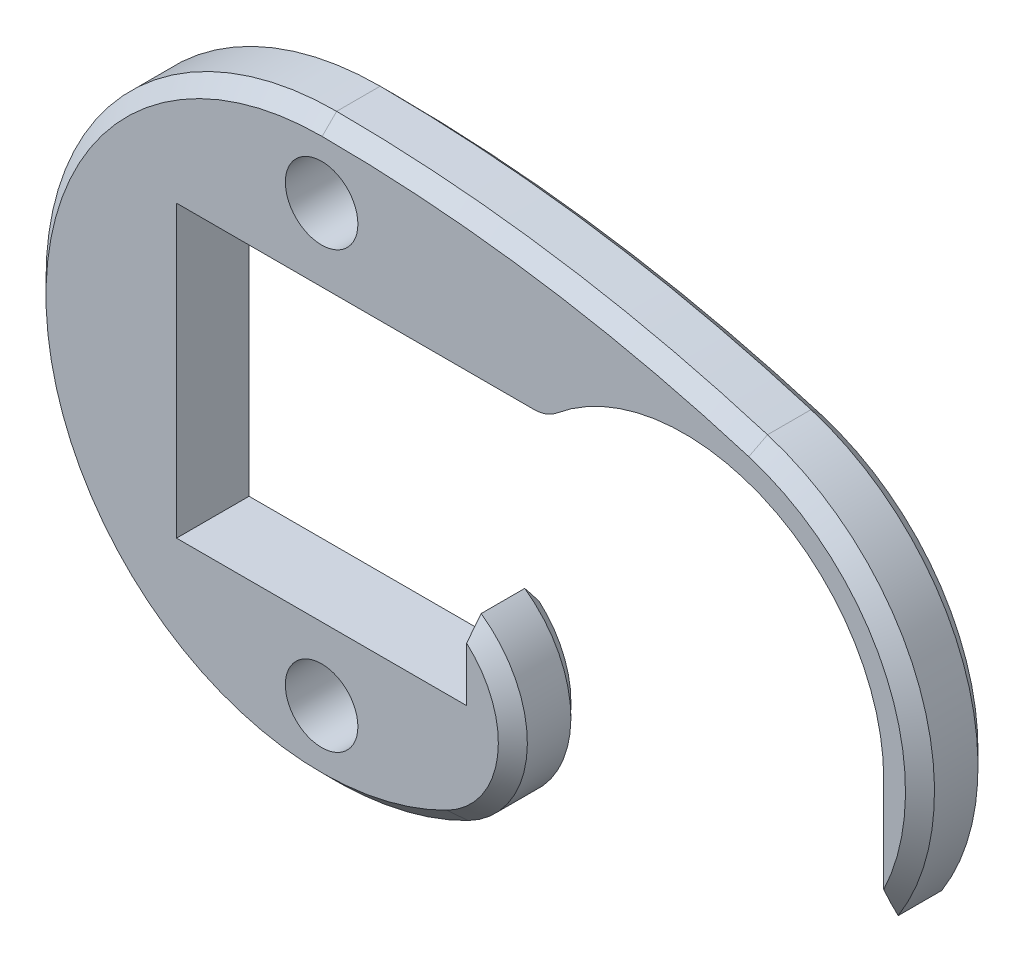
ISO-10303-21;
HEADER;
FILE_DESCRIPTION(('STEP AP214'),'2;1');
FILE_NAME('part.step','',(''),(''),'','','');
FILE_SCHEMA(('AUTOMOTIVE_DESIGN { 1 0 10303 214 1 1 1 1 }'));
ENDSEC;
DATA;
#1=APPLICATION_CONTEXT('core data for automotive mechanical design processes');
#2=APPLICATION_PROTOCOL_DEFINITION('international standard','automotive_design',2000,#1);
#3=PRODUCT_CONTEXT('',#1,'mechanical');
#4=PRODUCT('Part','Part','',(#3));
#5=PRODUCT_RELATED_PRODUCT_CATEGORY('part','',(#4));
#6=PRODUCT_DEFINITION_FORMATION('','',#4);
#7=PRODUCT_DEFINITION_CONTEXT('part definition',#1,'design');
#8=PRODUCT_DEFINITION('design','',#6,#7);
#9=PRODUCT_DEFINITION_SHAPE('','',#8);
#10=(LENGTH_UNIT() NAMED_UNIT(*) SI_UNIT(.MILLI.,.METRE.));
#11=(NAMED_UNIT(*) PLANE_ANGLE_UNIT() SI_UNIT($,.RADIAN.));
#12=(NAMED_UNIT(*) SI_UNIT($,.STERADIAN.) SOLID_ANGLE_UNIT());
#13=UNCERTAINTY_MEASURE_WITH_UNIT(LENGTH_MEASURE(1.E-05),#10,'distance_accuracy_value','');
#14=(GEOMETRIC_REPRESENTATION_CONTEXT(3) GLOBAL_UNCERTAINTY_ASSIGNED_CONTEXT((#13)) GLOBAL_UNIT_ASSIGNED_CONTEXT((#10,
#11,#12)) REPRESENTATION_CONTEXT('',''));
#15=CARTESIAN_POINT('',(0.,0.,0.));
#16=DIRECTION('',(0.,0.,1.));
#17=DIRECTION('',(1.,0.,0.));
#18=AXIS2_PLACEMENT_3D('',#15,#16,#17);
#19=CARTESIAN_POINT('',(-44.45,-12.7,3.175));
#20=DIRECTION('',(-1.,0.,0.));
#21=DIRECTION('',(0.,0.,1.));
#22=AXIS2_PLACEMENT_3D('',#19,#20,#21);
#23=PLANE('',#22);
#24=DIRECTION('',(0.,1.,0.));
#25=VECTOR('',#24,1.);
#26=CARTESIAN_POINT('',(-44.45,-12.7,-3.175));
#27=LINE('',#26,#25);
#28=CARTESIAN_POINT('',(-44.45,-12.7,-3.175));
#29=VERTEX_POINT('',#28);
#30=CARTESIAN_POINT('',(-44.45,12.7,-3.175));
#31=VERTEX_POINT('',#30);
#32=EDGE_CURVE('E185',#29,#31,#27,.T.);
#33=ORIENTED_EDGE('',*,*,#32,.T.);
#34=DIRECTION('',(0.,0.,-1.));
#35=VECTOR('',#34,1.);
#36=CARTESIAN_POINT('',(-44.45,12.7,3.175));
#37=LINE('',#36,#35);
#38=CARTESIAN_POINT('',(-44.45,12.7,3.175));
#39=VERTEX_POINT('',#38);
#40=EDGE_CURVE('E165',#39,#31,#37,.T.);
#41=ORIENTED_EDGE('',*,*,#40,.F.);
#42=DIRECTION('',(0.,1.,0.));
#43=VECTOR('',#42,1.);
#44=CARTESIAN_POINT('',(-44.45,-12.7,3.175));
#45=LINE('',#44,#43);
#46=CARTESIAN_POINT('',(-44.45,-12.7,3.175));
#47=VERTEX_POINT('',#46);
#48=EDGE_CURVE('E171',#47,#39,#45,.T.);
#49=ORIENTED_EDGE('',*,*,#48,.F.);
#50=DIRECTION('',(0.,0.,-1.));
#51=VECTOR('',#50,1.);
#52=CARTESIAN_POINT('',(-44.45,-12.7,3.175));
#53=LINE('',#52,#51);
#54=EDGE_CURVE('E351',#47,#29,#53,.T.);
#55=ORIENTED_EDGE('',*,*,#54,.T.);
#56=EDGE_LOOP('',(#33,#41,#49,#55));
#57=FACE_BOUND('',#56,.T.);
#58=ADVANCED_FACE('F46',(#57),#23,.F.);
#59=CARTESIAN_POINT('',(-44.45,12.7,3.175));
#60=DIRECTION('',(0.,1.,0.));
#61=DIRECTION('',(0.,0.,1.));
#62=AXIS2_PLACEMENT_3D('',#59,#60,#61);
#63=PLANE('',#62);
#64=DIRECTION('',(1.,0.,0.));
#65=VECTOR('',#64,1.);
#66=CARTESIAN_POINT('',(-44.45,12.7,-3.175));
#67=LINE('',#66,#65);
#68=CARTESIAN_POINT('',(-13.1867653823824,12.7,-3.175));
#69=VERTEX_POINT('',#68);
#70=EDGE_CURVE('E357',#31,#69,#67,.T.);
#71=ORIENTED_EDGE('',*,*,#70,.T.);
#72=DIRECTION('',(0.,0.,-1.));
#73=VECTOR('',#72,1.);
#74=CARTESIAN_POINT('',(-13.1867653823824,12.7,3.175));
#75=LINE('',#74,#73);
#76=CARTESIAN_POINT('',(-13.1867653823824,12.7,3.175));
#77=VERTEX_POINT('',#76);
#78=EDGE_CURVE('E168',#69,#77,#75,.F.);
#79=ORIENTED_EDGE('',*,*,#78,.T.);
#80=DIRECTION('',(1.,0.,0.));
#81=VECTOR('',#80,1.);
#82=CARTESIAN_POINT('',(-44.45,12.7,3.175));
#83=LINE('',#82,#81);
#84=EDGE_CURVE('E160',#39,#77,#83,.T.);
#85=ORIENTED_EDGE('',*,*,#84,.F.);
#86=ORIENTED_EDGE('',*,*,#40,.T.);
#87=EDGE_LOOP('',(#71,#79,#85,#86));
#88=FACE_BOUND('',#87,.T.);
#89=ADVANCED_FACE('F163',(#88),#63,.F.);
#90=CARTESIAN_POINT('',(0.,0.,3.175));
#91=DIRECTION('',(0.,0.,-1.));
#92=DIRECTION('',(-1.,0.,0.));
#93=AXIS2_PLACEMENT_3D('',#90,#91,#92);
#94=CYLINDRICAL_SURFACE('',#93,17.4625);
#95=CARTESIAN_POINT('',(0.,0.,3.175));
#96=DIRECTION('',(0.,0.,-1.));
#97=DIRECTION('',(1.,0.,0.));
#98=AXIS2_PLACEMENT_3D('',#95,#96,#97);
#99=CIRCLE('',#98,17.4625);
#100=CARTESIAN_POINT('',(-11.1580322466313,13.4326923076923,3.175));
#101=VERTEX_POINT('',#100);
#102=CARTESIAN_POINT('',(17.4625,0.,3.175));
#103=VERTEX_POINT('',#102);
#104=EDGE_CURVE('E170',#101,#103,#99,.T.);
#105=ORIENTED_EDGE('',*,*,#104,.F.);
#106=DIRECTION('',(0.,0.,-1.));
#107=VECTOR('',#106,1.);
#108=CARTESIAN_POINT('',(-11.1580322466313,13.4326923076923,3.175));
#109=LINE('',#108,#107);
#110=CARTESIAN_POINT('',(-11.1580322466313,13.4326923076923,-3.175));
#111=VERTEX_POINT('',#110);
#112=EDGE_CURVE('E186',#101,#111,#109,.T.);
#113=ORIENTED_EDGE('',*,*,#112,.T.);
#114=CARTESIAN_POINT('',(0.,0.,-3.175));
#115=DIRECTION('',(0.,0.,-1.));
#116=DIRECTION('',(1.,0.,0.));
#117=AXIS2_PLACEMENT_3D('',#114,#115,#116);
#118=CIRCLE('',#117,17.4625);
#119=CARTESIAN_POINT('',(17.4625,0.,-3.175));
#120=VERTEX_POINT('',#119);
#121=EDGE_CURVE('E360',#111,#120,#118,.T.);
#122=ORIENTED_EDGE('',*,*,#121,.T.);
#123=DIRECTION('',(0.,0.,-1.));
#124=VECTOR('',#123,1.);
#125=CARTESIAN_POINT('',(17.4625,0.,3.175));
#126=LINE('',#125,#124);
#127=EDGE_CURVE('E187',#103,#120,#126,.T.);
#128=ORIENTED_EDGE('',*,*,#127,.F.);
#129=EDGE_LOOP('',(#105,#113,#122,#128));
#130=FACE_BOUND('',#129,.T.);
#131=ADVANCED_FACE('F247',(#130),#94,.F.);
#132=CARTESIAN_POINT('',(17.4625,-10.9985226280624,3.175));
#133=DIRECTION('',(1.,0.,0.));
#134=DIRECTION('',(0.,1.,0.));
#135=AXIS2_PLACEMENT_3D('',#132,#133,#134);
#136=PLANE('',#135);
#137=DIRECTION('',(0.,-1.,0.));
#138=VECTOR('',#137,1.);
#139=CARTESIAN_POINT('',(17.4625,-10.9985226280624,-3.175));
#140=LINE('',#139,#138);
#141=CARTESIAN_POINT('',(17.4625,-8.3762252835033,-3.175));
#142=VERTEX_POINT('',#141);
#143=EDGE_CURVE('E362',#120,#142,#140,.T.);
#144=ORIENTED_EDGE('',*,*,#143,.T.);
#145=CARTESIAN_POINT('',(17.4625,-8.3762252835033,-3.175));
#146=CARTESIAN_POINT('',(17.4625,-8.59919625962574,-3.07856318760652));
#147=CARTESIAN_POINT('',(17.4625,-8.82102118509475,-2.97950052772163));
#148=CARTESIAN_POINT('',(17.4625,-9.26235587292495,-2.77657690041617));
#149=CARTESIAN_POINT('',(17.4625,-9.4818665545083,-2.67271793364534));
#150=CARTESIAN_POINT('',(17.4625,-9.91872471990675,-2.46057913898252));
#151=CARTESIAN_POINT('',(17.4625,-10.1360722946509,-2.35229949790403));
#152=CARTESIAN_POINT('',(17.4625,-10.5687862207038,-2.13163166167767));
#153=CARTESIAN_POINT('',(17.4625,-10.7841517155519,-2.01924178604076));
#154=CARTESIAN_POINT('',(17.4625,-10.9985226280624,-1.905));
#155=B_SPLINE_CURVE_WITH_KNOTS('',3,(#145,#146,#147,#148,#149,#150,#151,#152,#153,#154),
.UNSPECIFIED.,.F.,.F.,(4,2,2,2,4),(0.,0.728766437002155,1.45723158707932,2.18566598470928,
2.91440161095463),.UNSPECIFIED.);
#156=CARTESIAN_POINT('',(17.4625,-10.9985226280624,-1.90499999999999));
#157=VERTEX_POINT('',#156);
#158=EDGE_CURVE('E259',#142,#157,#155,.T.);
#159=ORIENTED_EDGE('',*,*,#158,.T.);
#160=DIRECTION('',(0.,0.,-1.));
#161=VECTOR('',#160,1.);
#162=CARTESIAN_POINT('',(17.4625,-10.9985226280624,3.175));
#163=LINE('',#162,#161);
#164=CARTESIAN_POINT('',(17.4625,-10.9985226280624,1.90499999999999));
#165=VERTEX_POINT('',#164);
#166=EDGE_CURVE('E193',#165,#157,#163,.T.);
#167=ORIENTED_EDGE('',*,*,#166,.F.);
#168=CARTESIAN_POINT('',(17.4625,-10.9985226280624,1.90499999999999));
#169=CARTESIAN_POINT('',(17.4625,-10.7841517155519,2.01924178604076));
#170=CARTESIAN_POINT('',(17.4625,-10.5687862207038,2.13163166167767));
#171=CARTESIAN_POINT('',(17.4625,-10.1360722946509,2.35229949790403));
#172=CARTESIAN_POINT('',(17.4625,-9.91872471990674,2.46057913898252));
#173=CARTESIAN_POINT('',(17.4625,-9.48186655450829,2.67271793364534));
#174=CARTESIAN_POINT('',(17.4625,-9.26235587292494,2.77657690041617));
#175=CARTESIAN_POINT('',(17.4625,-8.82102118509474,2.97950052772164));
#176=CARTESIAN_POINT('',(17.4625,-8.59919625962572,3.07856318760653));
#177=CARTESIAN_POINT('',(17.4625,-8.37622528350328,3.175));
#178=B_SPLINE_CURVE_WITH_KNOTS('',3,(#168,#169,#170,#171,#172,#173,#174,#175,#176,#177),
.UNSPECIFIED.,.F.,.F.,(4,2,2,2,4),(0.,0.728735626245356,1.45717002387532,2.18563517395249,
2.91440161095465),.UNSPECIFIED.);
#179=CARTESIAN_POINT('',(17.4625,-8.37622528350329,3.175));
#180=VERTEX_POINT('',#179);
#181=EDGE_CURVE('E252',#165,#180,#178,.T.);
#182=ORIENTED_EDGE('',*,*,#181,.T.);
#183=DIRECTION('',(0.,-1.,0.));
#184=VECTOR('',#183,1.);
#185=CARTESIAN_POINT('',(17.4625,-10.9985226280624,3.175));
#186=LINE('',#185,#184);
#187=EDGE_CURVE('E349',#103,#180,#186,.T.);
#188=ORIENTED_EDGE('',*,*,#187,.F.);
#189=ORIENTED_EDGE('',*,*,#127,.T.);
#190=EDGE_LOOP('',(#144,#159,#167,#182,#188,#189));
#191=FACE_BOUND('',#190,.T.);
#192=ADVANCED_FACE('F242',(#191),#136,.F.);
#193=CARTESIAN_POINT('',(0.,0.,3.175));
#194=DIRECTION('',(0.,0.,-1.));
#195=DIRECTION('',(-1.,0.,0.));
#196=AXIS2_PLACEMENT_3D('',#193,#194,#195);
#197=CYLINDRICAL_SURFACE('',#196,20.6375);
#198=ORIENTED_EDGE('',*,*,#166,.T.);
#199=CARTESIAN_POINT('',(0.,0.,-1.90499999999999));
#200=DIRECTION('',(0.,0.,1.));
#201=DIRECTION('',(1.,0.,0.));
#202=AXIS2_PLACEMENT_3D('',#199,#200,#201);
#203=CIRCLE('',#202,20.6375);
#204=CARTESIAN_POINT('',(6.01927083333334,19.7401819871293,-1.90499999999999));
#205=VERTEX_POINT('',#204);
#206=EDGE_CURVE('E384',#157,#205,#203,.T.);
#207=ORIENTED_EDGE('',*,*,#206,.T.);
#208=DIRECTION('',(0.,0.,-1.));
#209=VECTOR('',#208,1.);
#210=CARTESIAN_POINT('',(6.01927083333334,19.7401819871293,3.175));
#211=LINE('',#210,#209);
#212=CARTESIAN_POINT('',(6.01927083333334,19.7401819871293,1.90499999999999));
#213=VERTEX_POINT('',#212);
#214=EDGE_CURVE('E378',#213,#205,#211,.T.);
#215=ORIENTED_EDGE('',*,*,#214,.F.);
#216=CARTESIAN_POINT('',(0.,0.,1.90499999999999));
#217=DIRECTION('',(0.,0.,1.));
#218=DIRECTION('',(1.,0.,0.));
#219=AXIS2_PLACEMENT_3D('',#216,#217,#218);
#220=CIRCLE('',#219,20.6375);
#221=EDGE_CURVE('E386',#213,#165,#220,.F.);
#222=ORIENTED_EDGE('',*,*,#221,.T.);
#223=EDGE_LOOP('',(#198,#207,#215,#222));
#224=FACE_BOUND('',#223,.T.);
#225=ADVANCED_FACE('F238',(#224),#197,.T.);
#226=CARTESIAN_POINT('',(-31.9484375,-104.774812085532,3.175));
#227=DIRECTION('',(0.,0.,-1.));
#228=DIRECTION('',(-1.,0.,0.));
#229=AXIS2_PLACEMENT_3D('',#226,#227,#228);
#230=CYLINDRICAL_SURFACE('',#229,130.175);
#231=ORIENTED_EDGE('',*,*,#214,.T.);
#232=CARTESIAN_POINT('',(-31.9484375,-104.774812085532,-1.90499999999999));
#233=DIRECTION('',(0.,0.,1.));
#234=DIRECTION('',(1.,0.,0.));
#235=AXIS2_PLACEMENT_3D('',#232,#233,#234);
#236=CIRCLE('',#235,130.175);
#237=CARTESIAN_POINT('',(-31.7018939393939,25.3999544449775,-1.90499999999999));
#238=VERTEX_POINT('',#237);
#239=EDGE_CURVE('E391',#205,#238,#236,.T.);
#240=ORIENTED_EDGE('',*,*,#239,.T.);
#241=DIRECTION('',(0.,0.,-1.));
#242=VECTOR('',#241,1.);
#243=CARTESIAN_POINT('',(-31.7018939393939,25.3999544449775,3.175));
#244=LINE('',#243,#242);
#245=CARTESIAN_POINT('',(-31.7018939393939,25.3999544449775,1.90499999999999));
#246=VERTEX_POINT('',#245);
#247=EDGE_CURVE('E375',#246,#238,#244,.T.);
#248=ORIENTED_EDGE('',*,*,#247,.F.);
#249=CARTESIAN_POINT('',(-31.9484375,-104.774812085532,1.90499999999999));
#250=DIRECTION('',(0.,0.,1.));
#251=DIRECTION('',(1.,0.,0.));
#252=AXIS2_PLACEMENT_3D('',#249,#250,#251);
#253=CIRCLE('',#252,130.175);
#254=EDGE_CURVE('E395',#246,#213,#253,.F.);
#255=ORIENTED_EDGE('',*,*,#254,.T.);
#256=EDGE_LOOP('',(#231,#240,#248,#255));
#257=FACE_BOUND('',#256,.T.);
#258=ADVANCED_FACE('F234',(#257),#230,.T.);
#259=CARTESIAN_POINT('',(-31.75,0.,3.175));
#260=DIRECTION('',(0.,0.,-1.));
#261=DIRECTION('',(-1.,0.,0.));
#262=AXIS2_PLACEMENT_3D('',#259,#260,#261);
#263=CYLINDRICAL_SURFACE('',#262,25.4);
#264=ORIENTED_EDGE('',*,*,#247,.T.);
#265=CARTESIAN_POINT('',(-31.75,0.,-1.90499999999999));
#266=DIRECTION('',(0.,0.,1.));
#267=DIRECTION('',(1.,0.,0.));
#268=AXIS2_PLACEMENT_3D('',#265,#266,#267);
#269=CIRCLE('',#268,25.4);
#270=CARTESIAN_POINT('',(-20.2013815740022,-22.6227631480043,-1.90499999999999));
#271=VERTEX_POINT('',#270);
#272=EDGE_CURVE('E320',#238,#271,#269,.T.);
#273=ORIENTED_EDGE('',*,*,#272,.T.);
#274=DIRECTION('',(0.,0.,-1.));
#275=VECTOR('',#274,1.);
#276=CARTESIAN_POINT('',(-20.2013815740022,-22.6227631480043,3.175));
#277=LINE('',#276,#275);
#278=CARTESIAN_POINT('',(-20.2013815740022,-22.6227631480043,1.90499999999999));
#279=VERTEX_POINT('',#278);
#280=EDGE_CURVE('E372',#279,#271,#277,.T.);
#281=ORIENTED_EDGE('',*,*,#280,.F.);
#282=CARTESIAN_POINT('',(-31.75,0.,1.90499999999999));
#283=DIRECTION('',(0.,0.,1.));
#284=DIRECTION('',(1.,0.,0.));
#285=AXIS2_PLACEMENT_3D('',#282,#283,#284);
#286=CIRCLE('',#285,25.4);
#287=EDGE_CURVE('E338',#279,#246,#286,.F.);
#288=ORIENTED_EDGE('',*,*,#287,.T.);
#289=EDGE_LOOP('',(#264,#273,#281,#288));
#290=FACE_BOUND('',#289,.T.);
#291=ADVANCED_FACE('F230',(#290),#263,.T.);
#292=CARTESIAN_POINT('',(-24.5321134837514,-14.1392269675027,3.175));
#293=DIRECTION('',(0.,0.,-1.));
#294=DIRECTION('',(-1.,0.,0.));
#295=AXIS2_PLACEMENT_3D('',#292,#293,#294);
#296=CYLINDRICAL_SURFACE('',#295,9.525);
#297=ORIENTED_EDGE('',*,*,#280,.T.);
#298=CARTESIAN_POINT('',(-24.5321134837514,-14.1392269675027,-1.90499999999999));
#299=DIRECTION('',(0.,0.,1.));
#300=DIRECTION('',(1.,0.,0.));
#301=AXIS2_PLACEMENT_3D('',#298,#299,#300);
#302=CIRCLE('',#301,9.525);
#303=CARTESIAN_POINT('',(-19.05,-6.35,-1.90499999999999));
#304=VERTEX_POINT('',#303);
#305=EDGE_CURVE('E203',#271,#304,#302,.T.);
#306=ORIENTED_EDGE('',*,*,#305,.T.);
#307=DIRECTION('',(0.,0.,-1.));
#308=VECTOR('',#307,1.);
#309=CARTESIAN_POINT('',(-19.05,-6.35,3.175));
#310=LINE('',#309,#308);
#311=CARTESIAN_POINT('',(-19.05,-6.35,1.90499999999999));
#312=VERTEX_POINT('',#311);
#313=EDGE_CURVE('E370',#312,#304,#310,.T.);
#314=ORIENTED_EDGE('',*,*,#313,.F.);
#315=CARTESIAN_POINT('',(-24.5321134837514,-14.1392269675027,1.90499999999999));
#316=DIRECTION('',(0.,0.,1.));
#317=DIRECTION('',(1.,0.,0.));
#318=AXIS2_PLACEMENT_3D('',#315,#316,#317);
#319=CIRCLE('',#318,9.525);
#320=EDGE_CURVE('E201',#312,#279,#319,.F.);
#321=ORIENTED_EDGE('',*,*,#320,.T.);
#322=EDGE_LOOP('',(#297,#306,#314,#321));
#323=FACE_BOUND('',#322,.T.);
#324=ADVANCED_FACE('F224',(#323),#296,.T.);
#325=CARTESIAN_POINT('',(-19.05,-12.7,3.175));
#326=DIRECTION('',(1.,0.,0.));
#327=DIRECTION('',(0.,0.,-1.));
#328=AXIS2_PLACEMENT_3D('',#325,#326,#327);
#329=PLANE('',#328);
#330=ORIENTED_EDGE('',*,*,#313,.T.);
#331=CARTESIAN_POINT('',(-19.05,-6.35,-1.90499999999999));
#332=CARTESIAN_POINT('',(-19.05,-6.48267794292335,-2.01349262529382));
#333=CARTESIAN_POINT('',(-19.05,-6.61580056629095,-2.12144445828109));
#334=CARTESIAN_POINT('',(-19.05,-6.88304075114208,-2.33607684838612));
#335=CARTESIAN_POINT('',(-19.05,-7.01715819472569,-2.44275755236442));
#336=CARTESIAN_POINT('',(-19.05,-7.2865277837613,-2.6546859752937));
#337=CARTESIAN_POINT('',(-19.05,-7.4217799567828,-2.75993365926394));
#338=CARTESIAN_POINT('',(-19.05,-7.6935822500914,-2.96877167981918));
#339=CARTESIAN_POINT('',(-19.05,-7.830132520164,-3.07236182134981));
#340=CARTESIAN_POINT('',(-19.05,-7.96739930049262,-3.175));
#341=B_SPLINE_CURVE_WITH_KNOTS('',3,(#331,#332,#333,#334,#335,#336,#337,#338,#339,#340),
.UNSPECIFIED.,.F.,.F.,(4,2,2,2,4),(0.,0.514167390157872,1.02827478818611,1.54239471340719,
2.05657470017516),.UNSPECIFIED.);
#342=CARTESIAN_POINT('',(-19.05,-7.96739930049262,-3.175));
#343=VERTEX_POINT('',#342);
#344=EDGE_CURVE('E212',#304,#343,#341,.T.);
#345=ORIENTED_EDGE('',*,*,#344,.T.);
#346=DIRECTION('',(0.,-1.,0.));
#347=VECTOR('',#346,1.);
#348=CARTESIAN_POINT('',(-19.05,-12.7,-3.175));
#349=LINE('',#348,#347);
#350=CARTESIAN_POINT('',(-19.05,-12.7,-3.175));
#351=VERTEX_POINT('',#350);
#352=EDGE_CURVE('E365',#343,#351,#349,.T.);
#353=ORIENTED_EDGE('',*,*,#352,.T.);
#354=DIRECTION('',(0.,0.,-1.));
#355=VECTOR('',#354,1.);
#356=CARTESIAN_POINT('',(-19.05,-12.7,3.175));
#357=LINE('',#356,#355);
#358=CARTESIAN_POINT('',(-19.05,-12.7,3.175));
#359=VERTEX_POINT('',#358);
#360=EDGE_CURVE('E348',#359,#351,#357,.T.);
#361=ORIENTED_EDGE('',*,*,#360,.F.);
#362=DIRECTION('',(0.,-1.,0.));
#363=VECTOR('',#362,1.);
#364=CARTESIAN_POINT('',(-19.05,-12.7,3.175));
#365=LINE('',#364,#363);
#366=CARTESIAN_POINT('',(-19.05,-7.96739930049263,3.175));
#367=VERTEX_POINT('',#366);
#368=EDGE_CURVE('E343',#367,#359,#365,.T.);
#369=ORIENTED_EDGE('',*,*,#368,.F.);
#370=CARTESIAN_POINT('',(-19.05,-7.96739930049263,3.175));
#371=CARTESIAN_POINT('',(-19.05,-7.83013252016401,3.07236182134981));
#372=CARTESIAN_POINT('',(-19.05,-7.69358225009141,2.96877167981918));
#373=CARTESIAN_POINT('',(-19.05,-7.42177995678281,2.75993365926394));
#374=CARTESIAN_POINT('',(-19.05,-7.2865277837613,2.6546859752937));
#375=CARTESIAN_POINT('',(-19.05,-7.01715819472569,2.44275755236443));
#376=CARTESIAN_POINT('',(-19.05,-6.88304075114208,2.33607684838612));
#377=CARTESIAN_POINT('',(-19.05,-6.61580056629096,2.12144445828109));
#378=CARTESIAN_POINT('',(-19.05,-6.48267794292335,2.01349262529382));
#379=CARTESIAN_POINT('',(-19.05,-6.35,1.90499999999999));
#380=B_SPLINE_CURVE_WITH_KNOTS('',3,(#370,#371,#372,#373,#374,#375,#376,#377,#378,#379),
.UNSPECIFIED.,.F.,.F.,(4,2,2,2,4),(0.,0.514179986767978,1.02829991198906,1.5424073100173,
2.05657470017517),.UNSPECIFIED.);
#381=EDGE_CURVE('E206',#367,#312,#380,.T.);
#382=ORIENTED_EDGE('',*,*,#381,.T.);
#383=EDGE_LOOP('',(#330,#345,#353,#361,#369,#382));
#384=FACE_BOUND('',#383,.T.);
#385=ADVANCED_FACE('F218',(#384),#329,.F.);
#386=CARTESIAN_POINT('',(-19.05,-12.7,3.175));
#387=DIRECTION('',(0.,-1.,0.));
#388=DIRECTION('',(0.,0.,-1.));
#389=AXIS2_PLACEMENT_3D('',#386,#387,#388);
#390=PLANE('',#389);
#391=DIRECTION('',(-1.,0.,0.));
#392=VECTOR('',#391,1.);
#393=CARTESIAN_POINT('',(-19.05,-12.7,-3.175));
#394=LINE('',#393,#392);
#395=EDGE_CURVE('E182',#351,#29,#394,.T.);
#396=ORIENTED_EDGE('',*,*,#395,.T.);
#397=ORIENTED_EDGE('',*,*,#54,.F.);
#398=DIRECTION('',(-1.,0.,0.));
#399=VECTOR('',#398,1.);
#400=CARTESIAN_POINT('',(-19.05,-12.7,3.175));
#401=LINE('',#400,#399);
#402=EDGE_CURVE('E178',#359,#47,#401,.T.);
#403=ORIENTED_EDGE('',*,*,#402,.F.);
#404=ORIENTED_EDGE('',*,*,#360,.T.);
#405=EDGE_LOOP('',(#396,#397,#403,#404));
#406=FACE_BOUND('',#405,.T.);
#407=ADVANCED_FACE('F223',(#406),#390,.F.);
#408=CARTESIAN_POINT('',(0.,0.,3.175));
#409=DIRECTION('',(0.,0.,1.));
#410=DIRECTION('',(1.,0.,0.));
#411=AXIS2_PLACEMENT_3D('',#408,#409,#410);
#412=PLANE('',#411);
#413=ORIENTED_EDGE('',*,*,#187,.T.);
#414=CARTESIAN_POINT('',(0.,0.,3.175));
#415=DIRECTION('',(0.,0.,1.));
#416=DIRECTION('',(1.,0.,0.));
#417=AXIS2_PLACEMENT_3D('',#414,#415,#416);
#418=CIRCLE('',#417,19.3675);
#419=CARTESIAN_POINT('',(5.64885416666666,18.5254015571521,3.175));
#420=VERTEX_POINT('',#419);
#421=EDGE_CURVE('E13',#180,#420,#418,.T.);
#422=ORIENTED_EDGE('',*,*,#421,.T.);
#423=CARTESIAN_POINT('',(-31.9484375,-104.774812085532,3.175));
#424=DIRECTION('',(0.,0.,1.));
#425=DIRECTION('',(1.,0.,0.));
#426=AXIS2_PLACEMENT_3D('',#423,#424,#425);
#427=CIRCLE('',#426,128.905);
#428=CARTESIAN_POINT('',(-31.7042992424242,24.1299567227287,3.175));
#429=VERTEX_POINT('',#428);
#430=EDGE_CURVE('E68',#420,#429,#427,.T.);
#431=ORIENTED_EDGE('',*,*,#430,.T.);
#432=CARTESIAN_POINT('',(-31.75,0.,3.175));
#433=DIRECTION('',(0.,0.,1.));
#434=DIRECTION('',(1.,0.,0.));
#435=AXIS2_PLACEMENT_3D('',#432,#433,#434);
#436=CIRCLE('',#435,24.13);
#437=CARTESIAN_POINT('',(-20.7788124953021,-21.4916249906041,3.175));
#438=VERTEX_POINT('',#437);
#439=EDGE_CURVE('E64',#429,#438,#436,.T.);
#440=ORIENTED_EDGE('',*,*,#439,.T.);
#441=CARTESIAN_POINT('',(-24.5321134837514,-14.1392269675027,3.175));
#442=DIRECTION('',(0.,0.,1.));
#443=DIRECTION('',(1.,0.,0.));
#444=AXIS2_PLACEMENT_3D('',#441,#442,#443);
#445=CIRCLE('',#444,8.25499999999998);
#446=EDGE_CURVE('E56',#438,#367,#445,.T.);
#447=ORIENTED_EDGE('',*,*,#446,.T.);
#448=ORIENTED_EDGE('',*,*,#368,.T.);
#449=ORIENTED_EDGE('',*,*,#402,.T.);
#450=ORIENTED_EDGE('',*,*,#48,.T.);
#451=ORIENTED_EDGE('',*,*,#84,.T.);
#452=CARTESIAN_POINT('',(-13.1867653823824,15.875,3.175));
#453=DIRECTION('',(0.,0.,1.));
#454=DIRECTION('',(1.,0.,0.));
#455=AXIS2_PLACEMENT_3D('',#452,#453,#454);
#456=CIRCLE('',#455,3.175);
#457=EDGE_CURVE('E199',#77,#101,#456,.T.);
#458=ORIENTED_EDGE('',*,*,#457,.T.);
#459=ORIENTED_EDGE('',*,*,#104,.T.);
#460=EDGE_LOOP('',(#413,#422,#431,#440,#447,#448,#449,#450,#451,#458,#459));
#461=FACE_BOUND('',#460,.T.);
#462=CARTESIAN_POINT('',(-31.75,-19.05,3.175));
#463=DIRECTION('',(0.,0.,1.));
#464=DIRECTION('',(1.,0.,0.));
#465=AXIS2_PLACEMENT_3D('',#462,#463,#464);
#466=CIRCLE('',#465,3.175);
#467=CARTESIAN_POINT('',(-28.575,-19.05,3.175));
#468=VERTEX_POINT('',#467);
#469=EDGE_CURVE('E358',#468,#468,#466,.T.);
#470=ORIENTED_EDGE('',*,*,#469,.F.);
#471=EDGE_LOOP('',(#470));
#472=FACE_BOUND('',#471,.T.);
#473=CARTESIAN_POINT('',(-31.75,19.05,3.175));
#474=DIRECTION('',(0.,0.,1.));
#475=DIRECTION('',(1.,0.,0.));
#476=AXIS2_PLACEMENT_3D('',#473,#474,#475);
#477=CIRCLE('',#476,3.175);
#478=CARTESIAN_POINT('',(-28.575,19.05,3.175));
#479=VERTEX_POINT('',#478);
#480=EDGE_CURVE('E571',#479,#479,#477,.T.);
#481=ORIENTED_EDGE('',*,*,#480,.F.);
#482=EDGE_LOOP('',(#481));
#483=FACE_BOUND('',#482,.T.);
#484=ADVANCED_FACE('F175',(#461,#472,#483),#412,.T.);
#485=CARTESIAN_POINT('',(0.,0.,-3.175));
#486=DIRECTION('',(0.,0.,1.));
#487=DIRECTION('',(1.,0.,0.));
#488=AXIS2_PLACEMENT_3D('',#485,#486,#487);
#489=PLANE('',#488);
#490=CARTESIAN_POINT('',(-31.75,-19.05,-3.175));
#491=DIRECTION('',(0.,0.,1.));
#492=DIRECTION('',(1.,0.,0.));
#493=AXIS2_PLACEMENT_3D('',#490,#491,#492);
#494=CIRCLE('',#493,3.175);
#495=CARTESIAN_POINT('',(-28.575,-19.05,-3.175));
#496=VERTEX_POINT('',#495);
#497=EDGE_CURVE('E570',#496,#496,#494,.T.);
#498=ORIENTED_EDGE('',*,*,#497,.T.);
#499=EDGE_LOOP('',(#498));
#500=FACE_BOUND('',#499,.T.);
#501=CARTESIAN_POINT('',(-31.75,19.05,-3.175));
#502=DIRECTION('',(0.,0.,1.));
#503=DIRECTION('',(-1.,0.,0.));
#504=AXIS2_PLACEMENT_3D('',#501,#502,#503);
#505=CIRCLE('',#504,3.175);
#506=CARTESIAN_POINT('',(-34.925,19.05,-3.175));
#507=VERTEX_POINT('',#506);
#508=EDGE_CURVE('E327',#507,#507,#505,.T.);
#509=ORIENTED_EDGE('',*,*,#508,.T.);
#510=EDGE_LOOP('',(#509));
#511=FACE_BOUND('',#510,.T.);
#512=ORIENTED_EDGE('',*,*,#352,.F.);
#513=CARTESIAN_POINT('',(-24.5321134837514,-14.1392269675027,-3.175));
#514=DIRECTION('',(0.,0.,1.));
#515=DIRECTION('',(1.,0.,0.));
#516=AXIS2_PLACEMENT_3D('',#513,#514,#515);
#517=CIRCLE('',#516,8.25499999999998);
#518=CARTESIAN_POINT('',(-20.7788124953021,-21.4916249906041,-3.175));
#519=VERTEX_POINT('',#518);
#520=EDGE_CURVE('E399',#343,#519,#517,.F.);
#521=ORIENTED_EDGE('',*,*,#520,.T.);
#522=CARTESIAN_POINT('',(-31.75,0.,-3.175));
#523=DIRECTION('',(0.,0.,1.));
#524=DIRECTION('',(1.,0.,0.));
#525=AXIS2_PLACEMENT_3D('',#522,#523,#524);
#526=CIRCLE('',#525,24.13);
#527=CARTESIAN_POINT('',(-31.7042992424242,24.1299567227286,-3.175));
#528=VERTEX_POINT('',#527);
#529=EDGE_CURVE('E318',#519,#528,#526,.F.);
#530=ORIENTED_EDGE('',*,*,#529,.T.);
#531=CARTESIAN_POINT('',(-31.9484375,-104.774812085532,-3.175));
#532=DIRECTION('',(0.,0.,1.));
#533=DIRECTION('',(1.,0.,0.));
#534=AXIS2_PLACEMENT_3D('',#531,#532,#533);
#535=CIRCLE('',#534,128.905);
#536=CARTESIAN_POINT('',(5.64885416666667,18.5254015571521,-3.175));
#537=VERTEX_POINT('',#536);
#538=EDGE_CURVE('E402',#528,#537,#535,.F.);
#539=ORIENTED_EDGE('',*,*,#538,.T.);
#540=CARTESIAN_POINT('',(0.,0.,-3.175));
#541=DIRECTION('',(0.,0.,1.));
#542=DIRECTION('',(1.,0.,0.));
#543=AXIS2_PLACEMENT_3D('',#540,#541,#542);
#544=CIRCLE('',#543,19.3675);
#545=EDGE_CURVE('E403',#537,#142,#544,.F.);
#546=ORIENTED_EDGE('',*,*,#545,.T.);
#547=ORIENTED_EDGE('',*,*,#143,.F.);
#548=ORIENTED_EDGE('',*,*,#121,.F.);
#549=CARTESIAN_POINT('',(-13.1867653823824,15.875,-3.175));
#550=DIRECTION('',(0.,0.,1.));
#551=DIRECTION('',(1.,0.,0.));
#552=AXIS2_PLACEMENT_3D('',#549,#550,#551);
#553=CIRCLE('',#552,3.175);
#554=EDGE_CURVE('E190',#111,#69,#553,.F.);
#555=ORIENTED_EDGE('',*,*,#554,.T.);
#556=ORIENTED_EDGE('',*,*,#70,.F.);
#557=ORIENTED_EDGE('',*,*,#32,.F.);
#558=ORIENTED_EDGE('',*,*,#395,.F.);
#559=EDGE_LOOP('',(#512,#521,#530,#539,#546,#547,#548,#555,#556,#557,#558));
#560=FACE_BOUND('',#559,.T.);
#561=ADVANCED_FACE('F300',(#500,#511,#560),#489,.F.);
#562=CARTESIAN_POINT('',(-13.1867653823824,15.875,3.175));
#563=DIRECTION('',(0.,0.,-1.));
#564=DIRECTION('',(-1.,0.,0.));
#565=AXIS2_PLACEMENT_3D('',#562,#563,#564);
#566=CYLINDRICAL_SURFACE('',#565,3.175);
#567=ORIENTED_EDGE('',*,*,#457,.F.);
#568=ORIENTED_EDGE('',*,*,#78,.F.);
#569=ORIENTED_EDGE('',*,*,#554,.F.);
#570=ORIENTED_EDGE('',*,*,#112,.F.);
#571=EDGE_LOOP('',(#567,#568,#569,#570));
#572=FACE_BOUND('',#571,.T.);
#573=ADVANCED_FACE('F297',(#572),#566,.T.);
#574=CARTESIAN_POINT('',(-31.75,19.05,-3.175));
#575=DIRECTION('',(0.,0.,1.));
#576=DIRECTION('',(1.,0.,0.));
#577=AXIS2_PLACEMENT_3D('',#574,#575,#576);
#578=CYLINDRICAL_SURFACE('',#577,3.175);
#579=ORIENTED_EDGE('',*,*,#480,.T.);
#580=EDGE_LOOP('',(#579));
#581=FACE_BOUND('',#580,.T.);
#582=ORIENTED_EDGE('',*,*,#508,.F.);
#583=EDGE_LOOP('',(#582));
#584=FACE_BOUND('',#583,.T.);
#585=ADVANCED_FACE('F299',(#581,#584),#578,.F.);
#586=CARTESIAN_POINT('',(-31.75,-19.05,-3.175));
#587=DIRECTION('',(0.,0.,1.));
#588=DIRECTION('',(1.,0.,0.));
#589=AXIS2_PLACEMENT_3D('',#586,#587,#588);
#590=CYLINDRICAL_SURFACE('',#589,3.175);
#591=ORIENTED_EDGE('',*,*,#469,.T.);
#592=EDGE_LOOP('',(#591));
#593=FACE_BOUND('',#592,.T.);
#594=ORIENTED_EDGE('',*,*,#497,.F.);
#595=EDGE_LOOP('',(#594));
#596=FACE_BOUND('',#595,.T.);
#597=ADVANCED_FACE('F271',(#593,#596),#590,.F.);
#598=CARTESIAN_POINT('',(0.,0.,-1.90499999999999));
#599=DIRECTION('',(0.,0.,1.));
#600=DIRECTION('',(1.,0.,0.));
#601=AXIS2_PLACEMENT_3D('',#598,#599,#600);
#602=CONICAL_SURFACE('',#601,20.6375,0.78539816339745);
#603=ORIENTED_EDGE('',*,*,#158,.F.);
#604=ORIENTED_EDGE('',*,*,#545,.F.);
#605=DIRECTION('',(-0.206239477846076,-0.676361795031163,-0.707106781186548));
#606=VECTOR('',#605,1.);
#607=CARTESIAN_POINT('',(6.01927083333333,19.7401819871293,-1.90499999999999));
#608=LINE('',#607,#606);
#609=EDGE_CURVE('E323',#205,#537,#608,.T.);
#610=ORIENTED_EDGE('',*,*,#609,.F.);
#611=ORIENTED_EDGE('',*,*,#206,.F.);
#612=EDGE_LOOP('',(#603,#604,#610,#611));
#613=FACE_BOUND('',#612,.T.);
#614=ADVANCED_FACE('F266',(#613),#602,.T.);
#615=CARTESIAN_POINT('',(-31.9484375,-104.774812085532,-1.90499999999999));
#616=DIRECTION('',(0.,0.,1.));
#617=DIRECTION('',(1.,0.,0.));
#618=AXIS2_PLACEMENT_3D('',#615,#616,#617);
#619=CONICAL_SURFACE('',#618,130.175,0.785398163397454);
#620=ORIENTED_EDGE('',*,*,#609,.T.);
#621=ORIENTED_EDGE('',*,*,#538,.F.);
#622=DIRECTION('',(-0.00133921738861261,-0.707105512987134,-0.707106781186539));
#623=VECTOR('',#622,1.);
#624=CARTESIAN_POINT('',(-31.7018939393939,25.3999544449775,-1.90499999999999));
#625=LINE('',#624,#623);
#626=EDGE_CURVE('E316',#238,#528,#625,.T.);
#627=ORIENTED_EDGE('',*,*,#626,.F.);
#628=ORIENTED_EDGE('',*,*,#239,.F.);
#629=EDGE_LOOP('',(#620,#621,#627,#628));
#630=FACE_BOUND('',#629,.T.);
#631=ADVANCED_FACE('F270',(#630),#619,.T.);
#632=CARTESIAN_POINT('',(-31.75,0.,-1.90499999999999));
#633=DIRECTION('',(0.,0.,1.));
#634=DIRECTION('',(1.,0.,0.));
#635=AXIS2_PLACEMENT_3D('',#632,#633,#634);
#636=CONICAL_SURFACE('',#635,25.4,0.78539816339745);
#637=ORIENTED_EDGE('',*,*,#626,.T.);
#638=ORIENTED_EDGE('',*,*,#529,.F.);
#639=DIRECTION('',(-0.321500252061379,0.62979170201303,-0.707106781186548));
#640=VECTOR('',#639,1.);
#641=CARTESIAN_POINT('',(-20.2013815740022,-22.6227631480043,-1.90499999999999));
#642=LINE('',#641,#640);
#643=EDGE_CURVE('E324',#271,#519,#642,.T.);
#644=ORIENTED_EDGE('',*,*,#643,.F.);
#645=ORIENTED_EDGE('',*,*,#272,.F.);
#646=EDGE_LOOP('',(#637,#638,#644,#645));
#647=FACE_BOUND('',#646,.T.);
#648=ADVANCED_FACE('F304',(#647),#636,.T.);
#649=CARTESIAN_POINT('',(-24.5321134837514,-14.1392269675027,-1.90499999999999));
#650=DIRECTION('',(0.,0.,1.));
#651=DIRECTION('',(1.,0.,0.));
#652=AXIS2_PLACEMENT_3D('',#649,#650,#651);
#653=CONICAL_SURFACE('',#652,9.525,0.78539816339745);
#654=ORIENTED_EDGE('',*,*,#643,.T.);
#655=ORIENTED_EDGE('',*,*,#520,.F.);
#656=ORIENTED_EDGE('',*,*,#344,.F.);
#657=ORIENTED_EDGE('',*,*,#305,.F.);
#658=EDGE_LOOP('',(#654,#655,#656,#657));
#659=FACE_BOUND('',#658,.T.);
#660=ADVANCED_FACE('F288',(#659),#653,.T.);
#661=CARTESIAN_POINT('',(-24.5321134837514,-14.1392269675027,3.175));
#662=DIRECTION('',(0.,0.,-1.));
#663=DIRECTION('',(-1.,0.,0.));
#664=AXIS2_PLACEMENT_3D('',#661,#662,#663);
#665=CONICAL_SURFACE('',#664,8.25499999999998,0.785398163397452);
#666=ORIENTED_EDGE('',*,*,#381,.F.);
#667=ORIENTED_EDGE('',*,*,#446,.F.);
#668=DIRECTION('',(-0.321500252061378,0.629791702013034,0.707106781186545));
#669=VECTOR('',#668,1.);
#670=CARTESIAN_POINT('',(-20.2013815740022,-22.6227631480043,1.90499999999999));
#671=LINE('',#670,#669);
#672=EDGE_CURVE('E51',#279,#438,#671,.T.);
#673=ORIENTED_EDGE('',*,*,#672,.F.);
#674=ORIENTED_EDGE('',*,*,#320,.F.);
#675=EDGE_LOOP('',(#666,#667,#673,#674));
#676=FACE_BOUND('',#675,.T.);
#677=ADVANCED_FACE('F48',(#676),#665,.T.);
#678=CARTESIAN_POINT('',(-31.75,0.,3.175));
#679=DIRECTION('',(0.,0.,-1.));
#680=DIRECTION('',(-1.,0.,0.));
#681=AXIS2_PLACEMENT_3D('',#678,#679,#680);
#682=CONICAL_SURFACE('',#681,24.13,0.785398163397451);
#683=ORIENTED_EDGE('',*,*,#672,.T.);
#684=ORIENTED_EDGE('',*,*,#439,.F.);
#685=DIRECTION('',(-0.00133921738861262,-0.707105512987128,0.707106781186545));
#686=VECTOR('',#685,1.);
#687=CARTESIAN_POINT('',(-31.7018939393939,25.3999544449775,1.90499999999999));
#688=LINE('',#687,#686);
#689=EDGE_CURVE('E332',#246,#429,#688,.T.);
#690=ORIENTED_EDGE('',*,*,#689,.F.);
#691=ORIENTED_EDGE('',*,*,#287,.F.);
#692=EDGE_LOOP('',(#683,#684,#690,#691));
#693=FACE_BOUND('',#692,.T.);
#694=ADVANCED_FACE('F281',(#693),#682,.T.);
#695=CARTESIAN_POINT('',(-31.9484375,-104.774812085532,3.175));
#696=DIRECTION('',(0.,0.,-1.));
#697=DIRECTION('',(-1.,0.,0.));
#698=AXIS2_PLACEMENT_3D('',#695,#696,#697);
#699=CONICAL_SURFACE('',#698,128.905,0.785398163397454);
#700=ORIENTED_EDGE('',*,*,#689,.T.);
#701=ORIENTED_EDGE('',*,*,#430,.F.);
#702=DIRECTION('',(-0.206239477846077,-0.676361795031165,0.707106781186546));
#703=VECTOR('',#702,1.);
#704=CARTESIAN_POINT('',(6.01927083333333,19.7401819871293,1.90499999999999));
#705=LINE('',#704,#703);
#706=EDGE_CURVE('E331',#213,#420,#705,.T.);
#707=ORIENTED_EDGE('',*,*,#706,.F.);
#708=ORIENTED_EDGE('',*,*,#254,.F.);
#709=EDGE_LOOP('',(#700,#701,#707,#708));
#710=FACE_BOUND('',#709,.T.);
#711=ADVANCED_FACE('F278',(#710),#699,.T.);
#712=CARTESIAN_POINT('',(0.,0.,3.175));
#713=DIRECTION('',(0.,0.,-1.));
#714=DIRECTION('',(-1.,0.,0.));
#715=AXIS2_PLACEMENT_3D('',#712,#713,#714);
#716=CONICAL_SURFACE('',#715,19.3675,0.785398163397451);
#717=ORIENTED_EDGE('',*,*,#181,.F.);
#718=ORIENTED_EDGE('',*,*,#221,.F.);
#719=ORIENTED_EDGE('',*,*,#706,.T.);
#720=ORIENTED_EDGE('',*,*,#421,.F.);
#721=EDGE_LOOP('',(#717,#718,#719,#720));
#722=FACE_BOUND('',#721,.T.);
#723=ADVANCED_FACE('F274',(#722),#716,.T.);
#724=CLOSED_SHELL('',(#58,#89,#131,#192,#225,#258,#291,#324,#385,#407,#484,#561,#573,#585,#597,
#614,#631,#648,#660,#677,#694,#711,#723));
#725=MANIFOLD_SOLID_BREP('B2',#724);
#726=ADVANCED_BREP_SHAPE_REPRESENTATION('',(#18,#725),#14);
#727=SHAPE_DEFINITION_REPRESENTATION(#9,#726);
ENDSEC;
END-ISO-10303-21;
